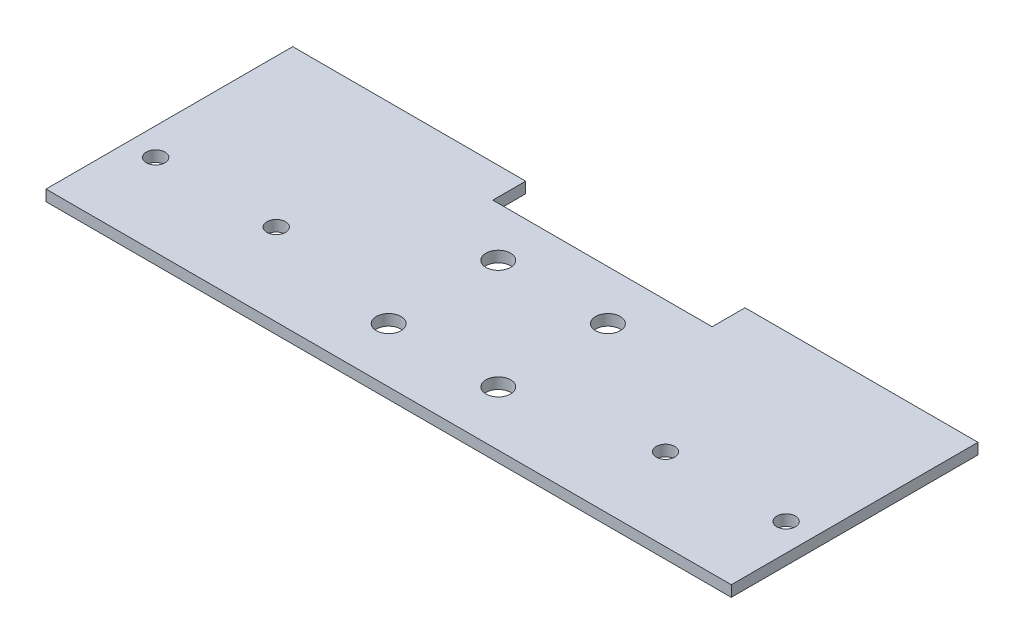
ISO-10303-21;
HEADER;
FILE_DESCRIPTION(('STEP AP214'),'2;1');
FILE_NAME('part.step','',(''),(''),'','','');
FILE_SCHEMA(('AUTOMOTIVE_DESIGN { 1 0 10303 214 1 1 1 1 }'));
ENDSEC;
DATA;
#1=APPLICATION_CONTEXT('core data for automotive mechanical design processes');
#2=APPLICATION_PROTOCOL_DEFINITION('international standard','automotive_design',2000,#1);
#3=PRODUCT_CONTEXT('',#1,'mechanical');
#4=PRODUCT('Part','Part','',(#3));
#5=PRODUCT_RELATED_PRODUCT_CATEGORY('part','',(#4));
#6=PRODUCT_DEFINITION_FORMATION('','',#4);
#7=PRODUCT_DEFINITION_CONTEXT('part definition',#1,'design');
#8=PRODUCT_DEFINITION('design','',#6,#7);
#9=PRODUCT_DEFINITION_SHAPE('','',#8);
#10=(LENGTH_UNIT() NAMED_UNIT(*) SI_UNIT(.MILLI.,.METRE.));
#11=(NAMED_UNIT(*) PLANE_ANGLE_UNIT() SI_UNIT($,.RADIAN.));
#12=(NAMED_UNIT(*) SI_UNIT($,.STERADIAN.) SOLID_ANGLE_UNIT());
#13=UNCERTAINTY_MEASURE_WITH_UNIT(LENGTH_MEASURE(1.E-05),#10,'distance_accuracy_value','');
#14=(GEOMETRIC_REPRESENTATION_CONTEXT(3) GLOBAL_UNCERTAINTY_ASSIGNED_CONTEXT((#13)) GLOBAL_UNIT_ASSIGNED_CONTEXT((#10,
#11,#12)) REPRESENTATION_CONTEXT('',''));
#15=CARTESIAN_POINT('',(0.,0.,0.));
#16=DIRECTION('',(0.,0.,1.));
#17=DIRECTION('',(1.,0.,0.));
#18=AXIS2_PLACEMENT_3D('',#15,#16,#17);
#19=CARTESIAN_POINT('',(-62.5,2.,-22.5));
#20=DIRECTION('',(0.,0.,1.));
#21=DIRECTION('',(1.,0.,0.));
#22=AXIS2_PLACEMENT_3D('',#19,#20,#21);
#23=PLANE('',#22);
#24=DIRECTION('',(-1.,0.,0.));
#25=VECTOR('',#24,1.);
#26=CARTESIAN_POINT('',(-62.5,2.,-22.5));
#27=LINE('',#26,#25);
#28=CARTESIAN_POINT('',(-20.,2.,-22.5));
#29=VERTEX_POINT('',#28);
#30=CARTESIAN_POINT('',(-62.5,2.,-22.5));
#31=VERTEX_POINT('',#30);
#32=EDGE_CURVE('E162',#29,#31,#27,.T.);
#33=ORIENTED_EDGE('',*,*,#32,.F.);
#34=DIRECTION('',(0.,1.,0.));
#35=VECTOR('',#34,1.);
#36=CARTESIAN_POINT('',(-20.,-8.,-22.5));
#37=LINE('',#36,#35);
#38=CARTESIAN_POINT('',(-20.,0.,-22.5));
#39=VERTEX_POINT('',#38);
#40=EDGE_CURVE('E122',#39,#29,#37,.T.);
#41=ORIENTED_EDGE('',*,*,#40,.F.);
#42=DIRECTION('',(-1.,0.,0.));
#43=VECTOR('',#42,1.);
#44=CARTESIAN_POINT('',(-62.5,0.,-22.5));
#45=LINE('',#44,#43);
#46=CARTESIAN_POINT('',(-62.5,0.,-22.5));
#47=VERTEX_POINT('',#46);
#48=EDGE_CURVE('E171',#39,#47,#45,.T.);
#49=ORIENTED_EDGE('',*,*,#48,.T.);
#50=DIRECTION('',(0.,-1.,0.));
#51=VECTOR('',#50,1.);
#52=CARTESIAN_POINT('',(-62.5,2.,-22.5));
#53=LINE('',#52,#51);
#54=EDGE_CURVE('E182',#31,#47,#53,.T.);
#55=ORIENTED_EDGE('',*,*,#54,.F.);
#56=EDGE_LOOP('',(#33,#41,#49,#55));
#57=FACE_BOUND('',#56,.T.);
#58=ADVANCED_FACE('F33',(#57),#23,.F.);
#59=CARTESIAN_POINT('',(62.5,2.,22.5));
#60=DIRECTION('',(-1.,0.,0.));
#61=DIRECTION('',(0.,0.,1.));
#62=AXIS2_PLACEMENT_3D('',#59,#60,#61);
#63=PLANE('',#62);
#64=DIRECTION('',(0.,0.,-1.));
#65=VECTOR('',#64,1.);
#66=CARTESIAN_POINT('',(62.5,0.,22.5));
#67=LINE('',#66,#65);
#68=CARTESIAN_POINT('',(62.5,0.,22.5));
#69=VERTEX_POINT('',#68);
#70=CARTESIAN_POINT('',(62.5,0.,-22.5));
#71=VERTEX_POINT('',#70);
#72=EDGE_CURVE('E168',#69,#71,#67,.T.);
#73=ORIENTED_EDGE('',*,*,#72,.T.);
#74=DIRECTION('',(0.,-1.,0.));
#75=VECTOR('',#74,1.);
#76=CARTESIAN_POINT('',(62.5,2.,-22.5));
#77=LINE('',#76,#75);
#78=CARTESIAN_POINT('',(62.5,2.,-22.5));
#79=VERTEX_POINT('',#78);
#80=EDGE_CURVE('E185',#79,#71,#77,.T.);
#81=ORIENTED_EDGE('',*,*,#80,.F.);
#82=DIRECTION('',(0.,0.,-1.));
#83=VECTOR('',#82,1.);
#84=CARTESIAN_POINT('',(62.5,2.,22.5));
#85=LINE('',#84,#83);
#86=CARTESIAN_POINT('',(62.5,2.,22.5));
#87=VERTEX_POINT('',#86);
#88=EDGE_CURVE('E160',#87,#79,#85,.T.);
#89=ORIENTED_EDGE('',*,*,#88,.F.);
#90=DIRECTION('',(0.,-1.,0.));
#91=VECTOR('',#90,1.);
#92=CARTESIAN_POINT('',(62.5,2.,22.5));
#93=LINE('',#92,#91);
#94=EDGE_CURVE('E167',#87,#69,#93,.T.);
#95=ORIENTED_EDGE('',*,*,#94,.T.);
#96=EDGE_LOOP('',(#73,#81,#89,#95));
#97=FACE_BOUND('',#96,.T.);
#98=ADVANCED_FACE('F35',(#97),#63,.F.);
#99=CARTESIAN_POINT('',(20.,0.,-22.5));
#100=VERTEX_POINT('',#99);
#101=EDGE_CURVE('E173',#71,#100,#45,.T.);
#102=ORIENTED_EDGE('',*,*,#101,.T.);
#103=DIRECTION('',(0.,1.,0.));
#104=VECTOR('',#103,1.);
#105=CARTESIAN_POINT('',(20.,-8.,-22.5));
#106=LINE('',#105,#104);
#107=CARTESIAN_POINT('',(20.,2.,-22.5));
#108=VERTEX_POINT('',#107);
#109=EDGE_CURVE('E131',#100,#108,#106,.T.);
#110=ORIENTED_EDGE('',*,*,#109,.T.);
#111=EDGE_CURVE('E86',#79,#108,#27,.T.);
#112=ORIENTED_EDGE('',*,*,#111,.F.);
#113=ORIENTED_EDGE('',*,*,#80,.T.);
#114=EDGE_LOOP('',(#102,#110,#112,#113));
#115=FACE_BOUND('',#114,.T.);
#116=ADVANCED_FACE('F226',(#115),#23,.F.);
#117=CARTESIAN_POINT('',(-62.5,2.,22.5));
#118=DIRECTION('',(1.,0.,0.));
#119=DIRECTION('',(0.,0.,-1.));
#120=AXIS2_PLACEMENT_3D('',#117,#118,#119);
#121=PLANE('',#120);
#122=DIRECTION('',(0.,0.,1.));
#123=VECTOR('',#122,1.);
#124=CARTESIAN_POINT('',(-62.5,0.,22.5));
#125=LINE('',#124,#123);
#126=CARTESIAN_POINT('',(-62.5,0.,22.5));
#127=VERTEX_POINT('',#126);
#128=EDGE_CURVE('E176',#47,#127,#125,.T.);
#129=ORIENTED_EDGE('',*,*,#128,.T.);
#130=DIRECTION('',(0.,-1.,0.));
#131=VECTOR('',#130,1.);
#132=CARTESIAN_POINT('',(-62.5,2.,22.5));
#133=LINE('',#132,#131);
#134=CARTESIAN_POINT('',(-62.5,2.,22.5));
#135=VERTEX_POINT('',#134);
#136=EDGE_CURVE('E180',#135,#127,#133,.T.);
#137=ORIENTED_EDGE('',*,*,#136,.F.);
#138=DIRECTION('',(0.,0.,1.));
#139=VECTOR('',#138,1.);
#140=CARTESIAN_POINT('',(-62.5,2.,22.5));
#141=LINE('',#140,#139);
#142=EDGE_CURVE('E164',#31,#135,#141,.T.);
#143=ORIENTED_EDGE('',*,*,#142,.F.);
#144=ORIENTED_EDGE('',*,*,#54,.T.);
#145=EDGE_LOOP('',(#129,#137,#143,#144));
#146=FACE_BOUND('',#145,.T.);
#147=ADVANCED_FACE('F220',(#146),#121,.F.);
#148=CARTESIAN_POINT('',(-62.5,2.,22.5));
#149=DIRECTION('',(0.,0.,-1.));
#150=DIRECTION('',(-1.,0.,0.));
#151=AXIS2_PLACEMENT_3D('',#148,#149,#150);
#152=PLANE('',#151);
#153=DIRECTION('',(1.,0.,0.));
#154=VECTOR('',#153,1.);
#155=CARTESIAN_POINT('',(-62.5,0.,22.5));
#156=LINE('',#155,#154);
#157=EDGE_CURVE('E78',#127,#69,#156,.T.);
#158=ORIENTED_EDGE('',*,*,#157,.T.);
#159=ORIENTED_EDGE('',*,*,#94,.F.);
#160=DIRECTION('',(1.,0.,0.));
#161=VECTOR('',#160,1.);
#162=CARTESIAN_POINT('',(-62.5,2.,22.5));
#163=LINE('',#162,#161);
#164=EDGE_CURVE('E57',#135,#87,#163,.T.);
#165=ORIENTED_EDGE('',*,*,#164,.F.);
#166=ORIENTED_EDGE('',*,*,#136,.T.);
#167=EDGE_LOOP('',(#158,#159,#165,#166));
#168=FACE_BOUND('',#167,.T.);
#169=ADVANCED_FACE('F221',(#168),#152,.F.);
#170=CARTESIAN_POINT('',(0.,2.,0.));
#171=DIRECTION('',(0.,-1.,0.));
#172=DIRECTION('',(0.,0.,-1.));
#173=AXIS2_PLACEMENT_3D('',#170,#171,#172);
#174=PLANE('',#173);
#175=CARTESIAN_POINT('',(57.5,2.,7.49999999999994));
#176=DIRECTION('',(0.,1.,0.));
#177=DIRECTION('',(0.,0.,1.));
#178=AXIS2_PLACEMENT_3D('',#175,#176,#177);
#179=CIRCLE('',#178,1.69999999999997);
#180=CARTESIAN_POINT('',(57.5,2.,9.19999999999991));
#181=VERTEX_POINT('',#180);
#182=EDGE_CURVE('E134',#181,#181,#179,.T.);
#183=ORIENTED_EDGE('',*,*,#182,.F.);
#184=EDGE_LOOP('',(#183));
#185=FACE_BOUND('',#184,.T.);
#186=CARTESIAN_POINT('',(35.5,2.,7.49999999999994));
#187=DIRECTION('',(0.,1.,0.));
#188=DIRECTION('',(0.,0.,1.));
#189=AXIS2_PLACEMENT_3D('',#186,#187,#188);
#190=CIRCLE('',#189,1.69999999999997);
#191=CARTESIAN_POINT('',(35.5,2.,9.19999999999991));
#192=VERTEX_POINT('',#191);
#193=EDGE_CURVE('E138',#192,#192,#190,.T.);
#194=ORIENTED_EDGE('',*,*,#193,.F.);
#195=EDGE_LOOP('',(#194));
#196=FACE_BOUND('',#195,.T.);
#197=CARTESIAN_POINT('',(-35.5047293938863,2.,7.5));
#198=DIRECTION('',(0.,1.,0.));
#199=DIRECTION('',(0.,0.,1.));
#200=AXIS2_PLACEMENT_3D('',#197,#198,#199);
#201=CIRCLE('',#200,1.69999999999999);
#202=CARTESIAN_POINT('',(-35.5047293938863,2.,9.19999999999999));
#203=VERTEX_POINT('',#202);
#204=EDGE_CURVE('E141',#203,#203,#201,.T.);
#205=ORIENTED_EDGE('',*,*,#204,.F.);
#206=EDGE_LOOP('',(#205));
#207=FACE_BOUND('',#206,.T.);
#208=CARTESIAN_POINT('',(-57.5,2.,7.5));
#209=DIRECTION('',(0.,1.,0.));
#210=DIRECTION('',(0.,0.,1.));
#211=AXIS2_PLACEMENT_3D('',#208,#209,#210);
#212=CIRCLE('',#211,1.69999999999999);
#213=CARTESIAN_POINT('',(-57.5,2.,9.19999999999999));
#214=VERTEX_POINT('',#213);
#215=EDGE_CURVE('E130',#214,#214,#212,.T.);
#216=ORIENTED_EDGE('',*,*,#215,.F.);
#217=EDGE_LOOP('',(#216));
#218=FACE_BOUND('',#217,.T.);
#219=CARTESIAN_POINT('',(10.,2.,-7.5));
#220=DIRECTION('',(0.,1.,0.));
#221=DIRECTION('',(0.,0.,1.));
#222=AXIS2_PLACEMENT_3D('',#219,#220,#221);
#223=CIRCLE('',#222,2.25);
#224=CARTESIAN_POINT('',(10.,2.,-5.25));
#225=VERTEX_POINT('',#224);
#226=EDGE_CURVE('E151',#225,#225,#223,.T.);
#227=ORIENTED_EDGE('',*,*,#226,.F.);
#228=EDGE_LOOP('',(#227));
#229=FACE_BOUND('',#228,.T.);
#230=CARTESIAN_POINT('',(-10.,2.,12.5));
#231=DIRECTION('',(0.,1.,0.));
#232=DIRECTION('',(0.,0.,1.));
#233=AXIS2_PLACEMENT_3D('',#230,#231,#232);
#234=CIRCLE('',#233,2.25);
#235=CARTESIAN_POINT('',(-10.,2.,14.75));
#236=VERTEX_POINT('',#235);
#237=EDGE_CURVE('E149',#236,#236,#234,.T.);
#238=ORIENTED_EDGE('',*,*,#237,.F.);
#239=EDGE_LOOP('',(#238));
#240=FACE_BOUND('',#239,.T.);
#241=CARTESIAN_POINT('',(10.,2.,12.5));
#242=DIRECTION('',(0.,1.,0.));
#243=DIRECTION('',(0.,0.,1.));
#244=AXIS2_PLACEMENT_3D('',#241,#242,#243);
#245=CIRCLE('',#244,2.25);
#246=CARTESIAN_POINT('',(10.,2.,14.75));
#247=VERTEX_POINT('',#246);
#248=EDGE_CURVE('E146',#247,#247,#245,.T.);
#249=ORIENTED_EDGE('',*,*,#248,.F.);
#250=EDGE_LOOP('',(#249));
#251=FACE_BOUND('',#250,.T.);
#252=CARTESIAN_POINT('',(-10.,2.,-7.5));
#253=DIRECTION('',(0.,1.,0.));
#254=DIRECTION('',(0.,0.,1.));
#255=AXIS2_PLACEMENT_3D('',#252,#253,#254);
#256=CIRCLE('',#255,2.25);
#257=CARTESIAN_POINT('',(-10.,2.,-5.25));
#258=VERTEX_POINT('',#257);
#259=EDGE_CURVE('E154',#258,#258,#256,.T.);
#260=ORIENTED_EDGE('',*,*,#259,.F.);
#261=EDGE_LOOP('',(#260));
#262=FACE_BOUND('',#261,.T.);
#263=DIRECTION('',(1.,0.,0.));
#264=VECTOR('',#263,1.);
#265=CARTESIAN_POINT('',(-20.,2.,-16.5));
#266=LINE('',#265,#264);
#267=CARTESIAN_POINT('',(-20.,2.,-16.5));
#268=VERTEX_POINT('',#267);
#269=CARTESIAN_POINT('',(20.,2.,-16.5));
#270=VERTEX_POINT('',#269);
#271=EDGE_CURVE('E110',#268,#270,#266,.T.);
#272=ORIENTED_EDGE('',*,*,#271,.F.);
#273=DIRECTION('',(0.,0.,1.));
#274=VECTOR('',#273,1.);
#275=CARTESIAN_POINT('',(-20.,2.,-22.5));
#276=LINE('',#275,#274);
#277=EDGE_CURVE('E119',#29,#268,#276,.T.);
#278=ORIENTED_EDGE('',*,*,#277,.F.);
#279=ORIENTED_EDGE('',*,*,#32,.T.);
#280=ORIENTED_EDGE('',*,*,#142,.T.);
#281=ORIENTED_EDGE('',*,*,#164,.T.);
#282=ORIENTED_EDGE('',*,*,#88,.T.);
#283=ORIENTED_EDGE('',*,*,#111,.T.);
#284=DIRECTION('',(0.,0.,-1.));
#285=VECTOR('',#284,1.);
#286=CARTESIAN_POINT('',(20.,2.,-22.5));
#287=LINE('',#286,#285);
#288=EDGE_CURVE('E116',#270,#108,#287,.T.);
#289=ORIENTED_EDGE('',*,*,#288,.F.);
#290=EDGE_LOOP('',(#272,#278,#279,#280,#281,#282,#283,#289));
#291=FACE_BOUND('',#290,.T.);
#292=ADVANCED_FACE('F125',(#185,#196,#207,#218,#229,#240,#251,#262,#291),#174,.F.);
#293=CARTESIAN_POINT('',(0.,0.,0.));
#294=DIRECTION('',(0.,-1.,0.));
#295=DIRECTION('',(0.,0.,-1.));
#296=AXIS2_PLACEMENT_3D('',#293,#294,#295);
#297=PLANE('',#296);
#298=DIRECTION('',(0.,0.,-1.));
#299=VECTOR('',#298,1.);
#300=CARTESIAN_POINT('',(-20.,0.,0.));
#301=LINE('',#300,#299);
#302=CARTESIAN_POINT('',(-20.,0.,-16.5));
#303=VERTEX_POINT('',#302);
#304=EDGE_CURVE('E11',#303,#39,#301,.T.);
#305=ORIENTED_EDGE('',*,*,#304,.F.);
#306=DIRECTION('',(-1.,0.,0.));
#307=VECTOR('',#306,1.);
#308=CARTESIAN_POINT('',(0.,0.,-16.5));
#309=LINE('',#308,#307);
#310=CARTESIAN_POINT('',(20.,0.,-16.5));
#311=VERTEX_POINT('',#310);
#312=EDGE_CURVE('E113',#311,#303,#309,.T.);
#313=ORIENTED_EDGE('',*,*,#312,.F.);
#314=DIRECTION('',(0.,0.,1.));
#315=VECTOR('',#314,1.);
#316=CARTESIAN_POINT('',(20.,0.,0.));
#317=LINE('',#316,#315);
#318=EDGE_CURVE('E41',#100,#311,#317,.T.);
#319=ORIENTED_EDGE('',*,*,#318,.F.);
#320=ORIENTED_EDGE('',*,*,#101,.F.);
#321=ORIENTED_EDGE('',*,*,#72,.F.);
#322=ORIENTED_EDGE('',*,*,#157,.F.);
#323=ORIENTED_EDGE('',*,*,#128,.F.);
#324=ORIENTED_EDGE('',*,*,#48,.F.);
#325=EDGE_LOOP('',(#305,#313,#319,#320,#321,#322,#323,#324));
#326=FACE_BOUND('',#325,.T.);
#327=CARTESIAN_POINT('',(57.5,0.,7.49999999999994));
#328=DIRECTION('',(0.,-1.,0.));
#329=DIRECTION('',(0.,0.,-1.));
#330=AXIS2_PLACEMENT_3D('',#327,#328,#329);
#331=CIRCLE('',#330,1.69999999999997);
#332=CARTESIAN_POINT('',(57.5,0.,5.79999999999997));
#333=VERTEX_POINT('',#332);
#334=EDGE_CURVE('E150',#333,#333,#331,.T.);
#335=ORIENTED_EDGE('',*,*,#334,.F.);
#336=EDGE_LOOP('',(#335));
#337=FACE_BOUND('',#336,.T.);
#338=CARTESIAN_POINT('',(35.5,0.,7.49999999999994));
#339=DIRECTION('',(0.,-1.,0.));
#340=DIRECTION('',(0.,0.,-1.));
#341=AXIS2_PLACEMENT_3D('',#338,#339,#340);
#342=CIRCLE('',#341,1.69999999999997);
#343=CARTESIAN_POINT('',(35.5,0.,5.79999999999997));
#344=VERTEX_POINT('',#343);
#345=EDGE_CURVE('E202',#344,#344,#342,.T.);
#346=ORIENTED_EDGE('',*,*,#345,.F.);
#347=EDGE_LOOP('',(#346));
#348=FACE_BOUND('',#347,.T.);
#349=CARTESIAN_POINT('',(-35.5047293938863,0.,7.5));
#350=DIRECTION('',(0.,-1.,0.));
#351=DIRECTION('',(0.,0.,-1.));
#352=AXIS2_PLACEMENT_3D('',#349,#350,#351);
#353=CIRCLE('',#352,1.69999999999999);
#354=CARTESIAN_POINT('',(-35.5047293938863,0.,5.80000000000001));
#355=VERTEX_POINT('',#354);
#356=EDGE_CURVE('E199',#355,#355,#353,.T.);
#357=ORIENTED_EDGE('',*,*,#356,.F.);
#358=EDGE_LOOP('',(#357));
#359=FACE_BOUND('',#358,.T.);
#360=CARTESIAN_POINT('',(-57.5,0.,7.5));
#361=DIRECTION('',(0.,-1.,0.));
#362=DIRECTION('',(0.,0.,-1.));
#363=AXIS2_PLACEMENT_3D('',#360,#361,#362);
#364=CIRCLE('',#363,1.69999999999999);
#365=CARTESIAN_POINT('',(-57.5,0.,5.80000000000001));
#366=VERTEX_POINT('',#365);
#367=EDGE_CURVE('E137',#366,#366,#364,.T.);
#368=ORIENTED_EDGE('',*,*,#367,.F.);
#369=EDGE_LOOP('',(#368));
#370=FACE_BOUND('',#369,.T.);
#371=CARTESIAN_POINT('',(10.,0.,-7.5));
#372=DIRECTION('',(0.,-1.,0.));
#373=DIRECTION('',(0.,0.,-1.));
#374=AXIS2_PLACEMENT_3D('',#371,#372,#373);
#375=CIRCLE('',#374,2.25);
#376=CARTESIAN_POINT('',(10.,0.,-9.75));
#377=VERTEX_POINT('',#376);
#378=EDGE_CURVE('E172',#377,#377,#375,.T.);
#379=ORIENTED_EDGE('',*,*,#378,.F.);
#380=EDGE_LOOP('',(#379));
#381=FACE_BOUND('',#380,.T.);
#382=CARTESIAN_POINT('',(-10.,0.,12.5));
#383=DIRECTION('',(0.,-1.,0.));
#384=DIRECTION('',(0.,0.,-1.));
#385=AXIS2_PLACEMENT_3D('',#382,#383,#384);
#386=CIRCLE('',#385,2.25);
#387=CARTESIAN_POINT('',(-10.,0.,10.25));
#388=VERTEX_POINT('',#387);
#389=EDGE_CURVE('E192',#388,#388,#386,.T.);
#390=ORIENTED_EDGE('',*,*,#389,.F.);
#391=EDGE_LOOP('',(#390));
#392=FACE_BOUND('',#391,.T.);
#393=CARTESIAN_POINT('',(10.,0.,12.5));
#394=DIRECTION('',(0.,-1.,0.));
#395=DIRECTION('',(0.,0.,-1.));
#396=AXIS2_PLACEMENT_3D('',#393,#394,#395);
#397=CIRCLE('',#396,2.25);
#398=CARTESIAN_POINT('',(10.,0.,10.25));
#399=VERTEX_POINT('',#398);
#400=EDGE_CURVE('E189',#399,#399,#397,.T.);
#401=ORIENTED_EDGE('',*,*,#400,.F.);
#402=EDGE_LOOP('',(#401));
#403=FACE_BOUND('',#402,.T.);
#404=CARTESIAN_POINT('',(-10.,0.,-7.5));
#405=DIRECTION('',(0.,-1.,0.));
#406=DIRECTION('',(0.,0.,-1.));
#407=AXIS2_PLACEMENT_3D('',#404,#405,#406);
#408=CIRCLE('',#407,2.25);
#409=CARTESIAN_POINT('',(-10.,0.,-9.75));
#410=VERTEX_POINT('',#409);
#411=EDGE_CURVE('E159',#410,#410,#408,.T.);
#412=ORIENTED_EDGE('',*,*,#411,.F.);
#413=EDGE_LOOP('',(#412));
#414=FACE_BOUND('',#413,.T.);
#415=ADVANCED_FACE('F211',(#326,#337,#348,#359,#370,#381,#392,#403,#414),#297,.T.);
#416=CARTESIAN_POINT('',(-10.,-8.,-7.5));
#417=DIRECTION('',(0.,1.,0.));
#418=DIRECTION('',(0.,0.,1.));
#419=AXIS2_PLACEMENT_3D('',#416,#417,#418);
#420=CYLINDRICAL_SURFACE('',#419,2.25);
#421=ORIENTED_EDGE('',*,*,#411,.T.);
#422=EDGE_LOOP('',(#421));
#423=FACE_BOUND('',#422,.T.);
#424=ORIENTED_EDGE('',*,*,#259,.T.);
#425=EDGE_LOOP('',(#424));
#426=FACE_BOUND('',#425,.T.);
#427=ADVANCED_FACE('F263',(#423,#426),#420,.F.);
#428=CARTESIAN_POINT('',(10.,-8.,12.5));
#429=DIRECTION('',(0.,1.,0.));
#430=DIRECTION('',(0.,0.,1.));
#431=AXIS2_PLACEMENT_3D('',#428,#429,#430);
#432=CYLINDRICAL_SURFACE('',#431,2.25);
#433=ORIENTED_EDGE('',*,*,#400,.T.);
#434=EDGE_LOOP('',(#433));
#435=FACE_BOUND('',#434,.T.);
#436=ORIENTED_EDGE('',*,*,#248,.T.);
#437=EDGE_LOOP('',(#436));
#438=FACE_BOUND('',#437,.T.);
#439=ADVANCED_FACE('F268',(#435,#438),#432,.F.);
#440=CARTESIAN_POINT('',(-10.,-8.,12.5));
#441=DIRECTION('',(0.,1.,0.));
#442=DIRECTION('',(0.,0.,1.));
#443=AXIS2_PLACEMENT_3D('',#440,#441,#442);
#444=CYLINDRICAL_SURFACE('',#443,2.25);
#445=ORIENTED_EDGE('',*,*,#389,.T.);
#446=EDGE_LOOP('',(#445));
#447=FACE_BOUND('',#446,.T.);
#448=ORIENTED_EDGE('',*,*,#237,.T.);
#449=EDGE_LOOP('',(#448));
#450=FACE_BOUND('',#449,.T.);
#451=ADVANCED_FACE('F280',(#447,#450),#444,.F.);
#452=CARTESIAN_POINT('',(10.,-8.,-7.5));
#453=DIRECTION('',(0.,1.,0.));
#454=DIRECTION('',(0.,0.,1.));
#455=AXIS2_PLACEMENT_3D('',#452,#453,#454);
#456=CYLINDRICAL_SURFACE('',#455,2.25);
#457=ORIENTED_EDGE('',*,*,#378,.T.);
#458=EDGE_LOOP('',(#457));
#459=FACE_BOUND('',#458,.T.);
#460=ORIENTED_EDGE('',*,*,#226,.T.);
#461=EDGE_LOOP('',(#460));
#462=FACE_BOUND('',#461,.T.);
#463=ADVANCED_FACE('F290',(#459,#462),#456,.F.);
#464=CARTESIAN_POINT('',(-57.5,-8.,7.5));
#465=DIRECTION('',(0.,1.,0.));
#466=DIRECTION('',(0.,0.,1.));
#467=AXIS2_PLACEMENT_3D('',#464,#465,#466);
#468=CYLINDRICAL_SURFACE('',#467,1.69999999999999);
#469=ORIENTED_EDGE('',*,*,#367,.T.);
#470=EDGE_LOOP('',(#469));
#471=FACE_BOUND('',#470,.T.);
#472=ORIENTED_EDGE('',*,*,#215,.T.);
#473=EDGE_LOOP('',(#472));
#474=FACE_BOUND('',#473,.T.);
#475=ADVANCED_FACE('F300',(#471,#474),#468,.F.);
#476=CARTESIAN_POINT('',(-35.5047293938863,-8.,7.5));
#477=DIRECTION('',(0.,1.,0.));
#478=DIRECTION('',(0.,0.,1.));
#479=AXIS2_PLACEMENT_3D('',#476,#477,#478);
#480=CYLINDRICAL_SURFACE('',#479,1.69999999999999);
#481=ORIENTED_EDGE('',*,*,#356,.T.);
#482=EDGE_LOOP('',(#481));
#483=FACE_BOUND('',#482,.T.);
#484=ORIENTED_EDGE('',*,*,#204,.T.);
#485=EDGE_LOOP('',(#484));
#486=FACE_BOUND('',#485,.T.);
#487=ADVANCED_FACE('F310',(#483,#486),#480,.F.);
#488=CARTESIAN_POINT('',(35.5,-8.,7.49999999999994));
#489=DIRECTION('',(0.,1.,0.));
#490=DIRECTION('',(0.,0.,1.));
#491=AXIS2_PLACEMENT_3D('',#488,#489,#490);
#492=CYLINDRICAL_SURFACE('',#491,1.69999999999997);
#493=ORIENTED_EDGE('',*,*,#345,.T.);
#494=EDGE_LOOP('',(#493));
#495=FACE_BOUND('',#494,.T.);
#496=ORIENTED_EDGE('',*,*,#193,.T.);
#497=EDGE_LOOP('',(#496));
#498=FACE_BOUND('',#497,.T.);
#499=ADVANCED_FACE('F320',(#495,#498),#492,.F.);
#500=CARTESIAN_POINT('',(57.5,-8.,7.49999999999994));
#501=DIRECTION('',(0.,1.,0.));
#502=DIRECTION('',(0.,0.,1.));
#503=AXIS2_PLACEMENT_3D('',#500,#501,#502);
#504=CYLINDRICAL_SURFACE('',#503,1.69999999999997);
#505=ORIENTED_EDGE('',*,*,#334,.T.);
#506=EDGE_LOOP('',(#505));
#507=FACE_BOUND('',#506,.T.);
#508=ORIENTED_EDGE('',*,*,#182,.T.);
#509=EDGE_LOOP('',(#508));
#510=FACE_BOUND('',#509,.T.);
#511=ADVANCED_FACE('F329',(#507,#510),#504,.F.);
#512=CARTESIAN_POINT('',(-20.,-8.,-22.5));
#513=DIRECTION('',(-1.,0.,0.));
#514=DIRECTION('',(0.,0.,1.));
#515=AXIS2_PLACEMENT_3D('',#512,#513,#514);
#516=PLANE('',#515);
#517=ORIENTED_EDGE('',*,*,#304,.T.);
#518=ORIENTED_EDGE('',*,*,#40,.T.);
#519=ORIENTED_EDGE('',*,*,#277,.T.);
#520=DIRECTION('',(0.,1.,0.));
#521=VECTOR('',#520,1.);
#522=CARTESIAN_POINT('',(-20.,-8.,-16.5));
#523=LINE('',#522,#521);
#524=EDGE_CURVE('E106',#303,#268,#523,.T.);
#525=ORIENTED_EDGE('',*,*,#524,.F.);
#526=EDGE_LOOP('',(#517,#518,#519,#525));
#527=FACE_BOUND('',#526,.T.);
#528=ADVANCED_FACE('F120',(#527),#516,.F.);
#529=CARTESIAN_POINT('',(20.,-8.,-22.5));
#530=DIRECTION('',(1.,0.,0.));
#531=DIRECTION('',(0.,0.,-1.));
#532=AXIS2_PLACEMENT_3D('',#529,#530,#531);
#533=PLANE('',#532);
#534=ORIENTED_EDGE('',*,*,#318,.T.);
#535=DIRECTION('',(0.,1.,0.));
#536=VECTOR('',#535,1.);
#537=CARTESIAN_POINT('',(20.,-8.,-16.5));
#538=LINE('',#537,#536);
#539=EDGE_CURVE('E48',#311,#270,#538,.T.);
#540=ORIENTED_EDGE('',*,*,#539,.T.);
#541=ORIENTED_EDGE('',*,*,#288,.T.);
#542=ORIENTED_EDGE('',*,*,#109,.F.);
#543=EDGE_LOOP('',(#534,#540,#541,#542));
#544=FACE_BOUND('',#543,.T.);
#545=ADVANCED_FACE('F209',(#544),#533,.F.);
#546=CARTESIAN_POINT('',(-20.,-8.,-16.5));
#547=DIRECTION('',(0.,0.,1.));
#548=DIRECTION('',(1.,0.,0.));
#549=AXIS2_PLACEMENT_3D('',#546,#547,#548);
#550=PLANE('',#549);
#551=ORIENTED_EDGE('',*,*,#312,.T.);
#552=ORIENTED_EDGE('',*,*,#524,.T.);
#553=ORIENTED_EDGE('',*,*,#271,.T.);
#554=ORIENTED_EDGE('',*,*,#539,.F.);
#555=EDGE_LOOP('',(#551,#552,#553,#554));
#556=FACE_BOUND('',#555,.T.);
#557=ADVANCED_FACE('F108',(#556),#550,.F.);
#558=CLOSED_SHELL('',(#58,#98,#116,#147,#169,#292,#415,#427,#439,#451,#463,#475,#487,#499,#511,
#528,#545,#557));
#559=MANIFOLD_SOLID_BREP('B2',#558);
#560=ADVANCED_BREP_SHAPE_REPRESENTATION('',(#18,#559),#14);
#561=SHAPE_DEFINITION_REPRESENTATION(#9,#560);
ENDSEC;
END-ISO-10303-21;
